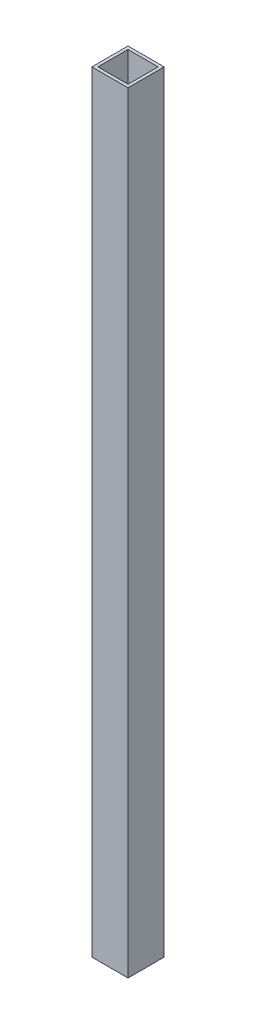
ISO-10303-21;
HEADER;
FILE_DESCRIPTION(('STEP AP214'),'2;1');
FILE_NAME('part.step','',(''),(''),'','','');
FILE_SCHEMA(('AUTOMOTIVE_DESIGN { 1 0 10303 214 1 1 1 1 }'));
ENDSEC;
DATA;
#1=APPLICATION_CONTEXT('core data for automotive mechanical design processes');
#2=APPLICATION_PROTOCOL_DEFINITION('international standard','automotive_design',2000,#1);
#3=PRODUCT_CONTEXT('',#1,'mechanical');
#4=PRODUCT('Part','Part','',(#3));
#5=PRODUCT_RELATED_PRODUCT_CATEGORY('part','',(#4));
#6=PRODUCT_DEFINITION_FORMATION('','',#4);
#7=PRODUCT_DEFINITION_CONTEXT('part definition',#1,'design');
#8=PRODUCT_DEFINITION('design','',#6,#7);
#9=PRODUCT_DEFINITION_SHAPE('','',#8);
#10=(LENGTH_UNIT() NAMED_UNIT(*) SI_UNIT(.MILLI.,.METRE.));
#11=(NAMED_UNIT(*) PLANE_ANGLE_UNIT() SI_UNIT($,.RADIAN.));
#12=(NAMED_UNIT(*) SI_UNIT($,.STERADIAN.) SOLID_ANGLE_UNIT());
#13=UNCERTAINTY_MEASURE_WITH_UNIT(LENGTH_MEASURE(1.E-05),#10,'distance_accuracy_value','');
#14=(GEOMETRIC_REPRESENTATION_CONTEXT(3) GLOBAL_UNCERTAINTY_ASSIGNED_CONTEXT((#13)) GLOBAL_UNIT_ASSIGNED_CONTEXT((#10,
#11,#12)) REPRESENTATION_CONTEXT('',''));
#15=CARTESIAN_POINT('',(0.,0.,0.));
#16=DIRECTION('',(0.,0.,1.));
#17=DIRECTION('',(1.,0.,0.));
#18=AXIS2_PLACEMENT_3D('',#15,#16,#17);
#19=CARTESIAN_POINT('',(0.,406.4,0.));
#20=DIRECTION('',(0.,-1.,0.));
#21=DIRECTION('',(0.,0.,-1.));
#22=AXIS2_PLACEMENT_3D('',#19,#20,#21);
#23=PLANE('',#22);
#24=DIRECTION('',(0.,0.,1.));
#25=VECTOR('',#24,1.);
#26=CARTESIAN_POINT('',(-9.525,406.4,-9.525));
#27=LINE('',#26,#25);
#28=CARTESIAN_POINT('',(-9.525,406.4,-9.525));
#29=VERTEX_POINT('',#28);
#30=CARTESIAN_POINT('',(-9.525,406.4,9.525));
#31=VERTEX_POINT('',#30);
#32=EDGE_CURVE('E157',#29,#31,#27,.T.);
#33=ORIENTED_EDGE('',*,*,#32,.T.);
#34=DIRECTION('',(1.,0.,0.));
#35=VECTOR('',#34,1.);
#36=CARTESIAN_POINT('',(9.525,406.4,9.525));
#37=LINE('',#36,#35);
#38=CARTESIAN_POINT('',(9.525,406.4,9.525));
#39=VERTEX_POINT('',#38);
#40=EDGE_CURVE('E161',#31,#39,#37,.T.);
#41=ORIENTED_EDGE('',*,*,#40,.T.);
#42=DIRECTION('',(0.,0.,-1.));
#43=VECTOR('',#42,1.);
#44=CARTESIAN_POINT('',(9.525,406.4,-9.525));
#45=LINE('',#44,#43);
#46=CARTESIAN_POINT('',(9.525,406.4,-9.525));
#47=VERTEX_POINT('',#46);
#48=EDGE_CURVE('E165',#39,#47,#45,.T.);
#49=ORIENTED_EDGE('',*,*,#48,.T.);
#50=DIRECTION('',(-1.,0.,0.));
#51=VECTOR('',#50,1.);
#52=CARTESIAN_POINT('',(9.525,406.4,-9.525));
#53=LINE('',#52,#51);
#54=EDGE_CURVE('E168',#47,#29,#53,.T.);
#55=ORIENTED_EDGE('',*,*,#54,.T.);
#56=EDGE_LOOP('',(#33,#41,#49,#55));
#57=FACE_BOUND('',#56,.T.);
#58=DIRECTION('',(-1.,0.,0.));
#59=VECTOR('',#58,1.);
#60=CARTESIAN_POINT('',(7.9375,406.4,-7.9375));
#61=LINE('',#60,#59);
#62=CARTESIAN_POINT('',(7.9375,406.4,-7.9375));
#63=VERTEX_POINT('',#62);
#64=CARTESIAN_POINT('',(-7.9375,406.4,-7.9375));
#65=VERTEX_POINT('',#64);
#66=EDGE_CURVE('E109',#63,#65,#61,.T.);
#67=ORIENTED_EDGE('',*,*,#66,.F.);
#68=DIRECTION('',(0.,0.,-1.));
#69=VECTOR('',#68,1.);
#70=CARTESIAN_POINT('',(7.9375,406.4,-7.9375));
#71=LINE('',#70,#69);
#72=CARTESIAN_POINT('',(7.9375,406.4,7.9375));
#73=VERTEX_POINT('',#72);
#74=EDGE_CURVE('E135',#73,#63,#71,.T.);
#75=ORIENTED_EDGE('',*,*,#74,.F.);
#76=DIRECTION('',(1.,0.,0.));
#77=VECTOR('',#76,1.);
#78=CARTESIAN_POINT('',(7.9375,406.4,7.9375));
#79=LINE('',#78,#77);
#80=CARTESIAN_POINT('',(-7.9375,406.4,7.9375));
#81=VERTEX_POINT('',#80);
#82=EDGE_CURVE('E131',#81,#73,#79,.T.);
#83=ORIENTED_EDGE('',*,*,#82,.F.);
#84=DIRECTION('',(0.,0.,1.));
#85=VECTOR('',#84,1.);
#86=CARTESIAN_POINT('',(-7.9375,406.4,-7.9375));
#87=LINE('',#86,#85);
#88=EDGE_CURVE('E118',#65,#81,#87,.T.);
#89=ORIENTED_EDGE('',*,*,#88,.F.);
#90=EDGE_LOOP('',(#67,#75,#83,#89));
#91=FACE_BOUND('',#90,.T.);
#92=ADVANCED_FACE('F43',(#57,#91),#23,.F.);
#93=CARTESIAN_POINT('',(0.,0.,0.));
#94=DIRECTION('',(0.,-1.,0.));
#95=DIRECTION('',(0.,0.,-1.));
#96=AXIS2_PLACEMENT_3D('',#93,#94,#95);
#97=PLANE('',#96);
#98=DIRECTION('',(0.,0.,1.));
#99=VECTOR('',#98,1.);
#100=CARTESIAN_POINT('',(-9.525,0.,-9.525));
#101=LINE('',#100,#99);
#102=CARTESIAN_POINT('',(-9.525,0.,-9.525));
#103=VERTEX_POINT('',#102);
#104=CARTESIAN_POINT('',(-9.525,0.,9.525));
#105=VERTEX_POINT('',#104);
#106=EDGE_CURVE('E127',#103,#105,#101,.T.);
#107=ORIENTED_EDGE('',*,*,#106,.F.);
#108=DIRECTION('',(-1.,0.,0.));
#109=VECTOR('',#108,1.);
#110=CARTESIAN_POINT('',(9.525,0.,-9.525));
#111=LINE('',#110,#109);
#112=CARTESIAN_POINT('',(9.525,0.,-9.525));
#113=VERTEX_POINT('',#112);
#114=EDGE_CURVE('E162',#113,#103,#111,.T.);
#115=ORIENTED_EDGE('',*,*,#114,.F.);
#116=DIRECTION('',(0.,0.,-1.));
#117=VECTOR('',#116,1.);
#118=CARTESIAN_POINT('',(9.525,0.,-9.525));
#119=LINE('',#118,#117);
#120=CARTESIAN_POINT('',(9.525,0.,9.525));
#121=VERTEX_POINT('',#120);
#122=EDGE_CURVE('E178',#121,#113,#119,.T.);
#123=ORIENTED_EDGE('',*,*,#122,.F.);
#124=DIRECTION('',(1.,0.,0.));
#125=VECTOR('',#124,1.);
#126=CARTESIAN_POINT('',(9.525,0.,9.525));
#127=LINE('',#126,#125);
#128=EDGE_CURVE('E175',#105,#121,#127,.T.);
#129=ORIENTED_EDGE('',*,*,#128,.F.);
#130=EDGE_LOOP('',(#107,#115,#123,#129));
#131=FACE_BOUND('',#130,.T.);
#132=DIRECTION('',(0.,0.,-1.));
#133=VECTOR('',#132,1.);
#134=CARTESIAN_POINT('',(7.9375,0.,-7.9375));
#135=LINE('',#134,#133);
#136=CARTESIAN_POINT('',(7.9375,0.,7.9375));
#137=VERTEX_POINT('',#136);
#138=CARTESIAN_POINT('',(7.9375,0.,-7.9375));
#139=VERTEX_POINT('',#138);
#140=EDGE_CURVE('E119',#137,#139,#135,.T.);
#141=ORIENTED_EDGE('',*,*,#140,.T.);
#142=DIRECTION('',(-1.,0.,0.));
#143=VECTOR('',#142,1.);
#144=CARTESIAN_POINT('',(7.9375,0.,-7.9375));
#145=LINE('',#144,#143);
#146=CARTESIAN_POINT('',(-7.9375,0.,-7.9375));
#147=VERTEX_POINT('',#146);
#148=EDGE_CURVE('E67',#139,#147,#145,.T.);
#149=ORIENTED_EDGE('',*,*,#148,.T.);
#150=DIRECTION('',(0.,0.,1.));
#151=VECTOR('',#150,1.);
#152=CARTESIAN_POINT('',(-7.9375,0.,-7.9375));
#153=LINE('',#152,#151);
#154=CARTESIAN_POINT('',(-7.9375,0.,7.9375));
#155=VERTEX_POINT('',#154);
#156=EDGE_CURVE('E125',#147,#155,#153,.T.);
#157=ORIENTED_EDGE('',*,*,#156,.T.);
#158=DIRECTION('',(1.,0.,0.));
#159=VECTOR('',#158,1.);
#160=CARTESIAN_POINT('',(7.9375,0.,7.9375));
#161=LINE('',#160,#159);
#162=EDGE_CURVE('E144',#155,#137,#161,.T.);
#163=ORIENTED_EDGE('',*,*,#162,.T.);
#164=EDGE_LOOP('',(#141,#149,#157,#163));
#165=FACE_BOUND('',#164,.T.);
#166=ADVANCED_FACE('F201',(#131,#165),#97,.T.);
#167=CARTESIAN_POINT('',(-9.525,406.4,-9.525));
#168=DIRECTION('',(1.,0.,0.));
#169=DIRECTION('',(0.,0.,-1.));
#170=AXIS2_PLACEMENT_3D('',#167,#168,#169);
#171=PLANE('',#170);
#172=ORIENTED_EDGE('',*,*,#106,.T.);
#173=DIRECTION('',(0.,-1.,0.));
#174=VECTOR('',#173,1.);
#175=CARTESIAN_POINT('',(-9.525,406.4,9.525));
#176=LINE('',#175,#174);
#177=EDGE_CURVE('E11',#31,#105,#176,.T.);
#178=ORIENTED_EDGE('',*,*,#177,.F.);
#179=ORIENTED_EDGE('',*,*,#32,.F.);
#180=DIRECTION('',(0.,-1.,0.));
#181=VECTOR('',#180,1.);
#182=CARTESIAN_POINT('',(-9.525,406.4,-9.525));
#183=LINE('',#182,#181);
#184=EDGE_CURVE('E171',#29,#103,#183,.T.);
#185=ORIENTED_EDGE('',*,*,#184,.T.);
#186=EDGE_LOOP('',(#172,#178,#179,#185));
#187=FACE_BOUND('',#186,.T.);
#188=ADVANCED_FACE('F45',(#187),#171,.F.);
#189=CARTESIAN_POINT('',(9.525,406.4,9.525));
#190=DIRECTION('',(0.,0.,-1.));
#191=DIRECTION('',(-1.,0.,0.));
#192=AXIS2_PLACEMENT_3D('',#189,#190,#191);
#193=PLANE('',#192);
#194=ORIENTED_EDGE('',*,*,#128,.T.);
#195=DIRECTION('',(0.,-1.,0.));
#196=VECTOR('',#195,1.);
#197=CARTESIAN_POINT('',(9.525,406.4,9.525));
#198=LINE('',#197,#196);
#199=EDGE_CURVE('E52',#39,#121,#198,.T.);
#200=ORIENTED_EDGE('',*,*,#199,.F.);
#201=ORIENTED_EDGE('',*,*,#40,.F.);
#202=ORIENTED_EDGE('',*,*,#177,.T.);
#203=EDGE_LOOP('',(#194,#200,#201,#202));
#204=FACE_BOUND('',#203,.T.);
#205=ADVANCED_FACE('F211',(#204),#193,.F.);
#206=CARTESIAN_POINT('',(9.525,406.4,-9.525));
#207=DIRECTION('',(-1.,0.,0.));
#208=DIRECTION('',(0.,0.,1.));
#209=AXIS2_PLACEMENT_3D('',#206,#207,#208);
#210=PLANE('',#209);
#211=ORIENTED_EDGE('',*,*,#122,.T.);
#212=DIRECTION('',(0.,-1.,0.));
#213=VECTOR('',#212,1.);
#214=CARTESIAN_POINT('',(9.525,406.4,-9.525));
#215=LINE('',#214,#213);
#216=EDGE_CURVE('E186',#47,#113,#215,.T.);
#217=ORIENTED_EDGE('',*,*,#216,.F.);
#218=ORIENTED_EDGE('',*,*,#48,.F.);
#219=ORIENTED_EDGE('',*,*,#199,.T.);
#220=EDGE_LOOP('',(#211,#217,#218,#219));
#221=FACE_BOUND('',#220,.T.);
#222=ADVANCED_FACE('F195',(#221),#210,.F.);
#223=CARTESIAN_POINT('',(9.525,406.4,-9.525));
#224=DIRECTION('',(0.,0.,1.));
#225=DIRECTION('',(1.,0.,0.));
#226=AXIS2_PLACEMENT_3D('',#223,#224,#225);
#227=PLANE('',#226);
#228=ORIENTED_EDGE('',*,*,#114,.T.);
#229=ORIENTED_EDGE('',*,*,#184,.F.);
#230=ORIENTED_EDGE('',*,*,#54,.F.);
#231=ORIENTED_EDGE('',*,*,#216,.T.);
#232=EDGE_LOOP('',(#228,#229,#230,#231));
#233=FACE_BOUND('',#232,.T.);
#234=ADVANCED_FACE('F205',(#233),#227,.F.);
#235=CARTESIAN_POINT('',(7.9375,406.4,-7.9375));
#236=DIRECTION('',(0.,0.,1.));
#237=DIRECTION('',(1.,0.,0.));
#238=AXIS2_PLACEMENT_3D('',#235,#236,#237);
#239=PLANE('',#238);
#240=ORIENTED_EDGE('',*,*,#148,.F.);
#241=DIRECTION('',(0.,-1.,0.));
#242=VECTOR('',#241,1.);
#243=CARTESIAN_POINT('',(7.9375,406.4,-7.9375));
#244=LINE('',#243,#242);
#245=EDGE_CURVE('E113',#63,#139,#244,.T.);
#246=ORIENTED_EDGE('',*,*,#245,.F.);
#247=ORIENTED_EDGE('',*,*,#66,.T.);
#248=DIRECTION('',(0.,-1.,0.));
#249=VECTOR('',#248,1.);
#250=CARTESIAN_POINT('',(-7.9375,406.4,-7.9375));
#251=LINE('',#250,#249);
#252=EDGE_CURVE('E112',#65,#147,#251,.T.);
#253=ORIENTED_EDGE('',*,*,#252,.T.);
#254=EDGE_LOOP('',(#240,#246,#247,#253));
#255=FACE_BOUND('',#254,.T.);
#256=ADVANCED_FACE('F111',(#255),#239,.T.);
#257=CARTESIAN_POINT('',(-7.9375,406.4,-7.9375));
#258=DIRECTION('',(1.,0.,0.));
#259=DIRECTION('',(0.,0.,-1.));
#260=AXIS2_PLACEMENT_3D('',#257,#258,#259);
#261=PLANE('',#260);
#262=ORIENTED_EDGE('',*,*,#156,.F.);
#263=ORIENTED_EDGE('',*,*,#252,.F.);
#264=ORIENTED_EDGE('',*,*,#88,.T.);
#265=DIRECTION('',(0.,-1.,0.));
#266=VECTOR('',#265,1.);
#267=CARTESIAN_POINT('',(-7.9375,406.4,7.9375));
#268=LINE('',#267,#266);
#269=EDGE_CURVE('E128',#81,#155,#268,.T.);
#270=ORIENTED_EDGE('',*,*,#269,.T.);
#271=EDGE_LOOP('',(#262,#263,#264,#270));
#272=FACE_BOUND('',#271,.T.);
#273=ADVANCED_FACE('F122',(#272),#261,.T.);
#274=CARTESIAN_POINT('',(7.9375,406.4,7.9375));
#275=DIRECTION('',(0.,0.,-1.));
#276=DIRECTION('',(-1.,0.,0.));
#277=AXIS2_PLACEMENT_3D('',#274,#275,#276);
#278=PLANE('',#277);
#279=ORIENTED_EDGE('',*,*,#162,.F.);
#280=ORIENTED_EDGE('',*,*,#269,.F.);
#281=ORIENTED_EDGE('',*,*,#82,.T.);
#282=DIRECTION('',(0.,-1.,0.));
#283=VECTOR('',#282,1.);
#284=CARTESIAN_POINT('',(7.9375,406.4,7.9375));
#285=LINE('',#284,#283);
#286=EDGE_CURVE('E59',#73,#137,#285,.T.);
#287=ORIENTED_EDGE('',*,*,#286,.T.);
#288=EDGE_LOOP('',(#279,#280,#281,#287));
#289=FACE_BOUND('',#288,.T.);
#290=ADVANCED_FACE('F234',(#289),#278,.T.);
#291=CARTESIAN_POINT('',(7.9375,406.4,-7.9375));
#292=DIRECTION('',(-1.,0.,0.));
#293=DIRECTION('',(0.,0.,1.));
#294=AXIS2_PLACEMENT_3D('',#291,#292,#293);
#295=PLANE('',#294);
#296=ORIENTED_EDGE('',*,*,#140,.F.);
#297=ORIENTED_EDGE('',*,*,#286,.F.);
#298=ORIENTED_EDGE('',*,*,#74,.T.);
#299=ORIENTED_EDGE('',*,*,#245,.T.);
#300=EDGE_LOOP('',(#296,#297,#298,#299));
#301=FACE_BOUND('',#300,.T.);
#302=ADVANCED_FACE('F238',(#301),#295,.T.);
#303=CLOSED_SHELL('',(#92,#166,#188,#205,#222,#234,#256,#273,#290,#302));
#304=MANIFOLD_SOLID_BREP('B2',#303);
#305=ADVANCED_BREP_SHAPE_REPRESENTATION('',(#18,#304),#14);
#306=SHAPE_DEFINITION_REPRESENTATION(#9,#305);
ENDSEC;
END-ISO-10303-21;
